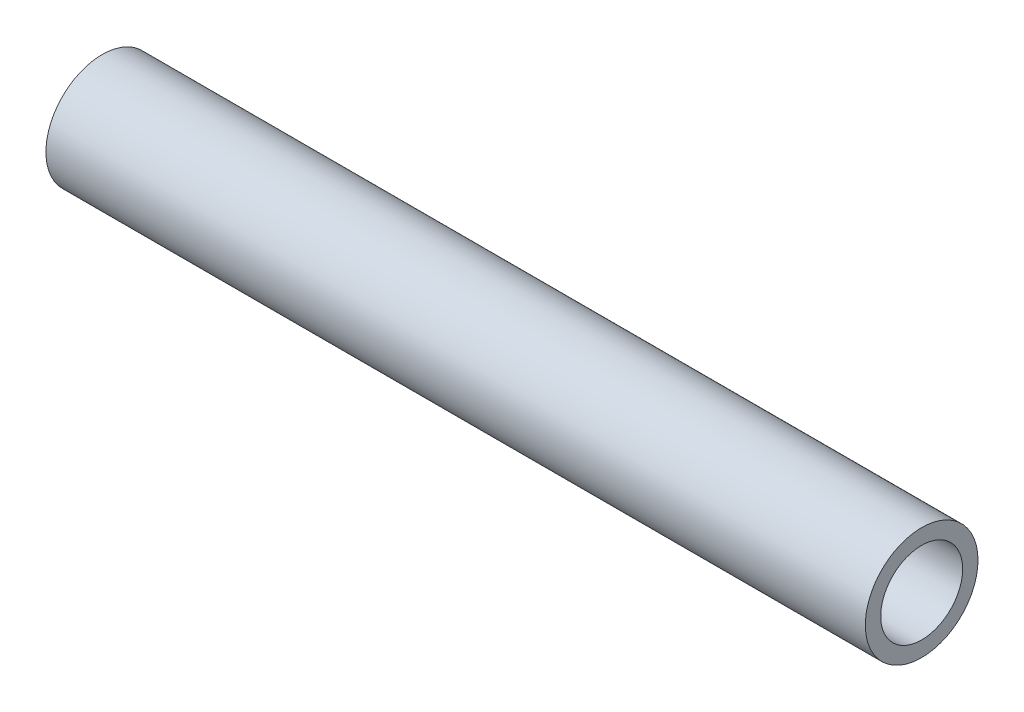
ISO-10303-21;
HEADER;
FILE_DESCRIPTION(('STEP AP214'),'2;1');
FILE_NAME('part.step','',(''),(''),'','','');
FILE_SCHEMA(('AUTOMOTIVE_DESIGN { 1 0 10303 214 1 1 1 1 }'));
ENDSEC;
DATA;
#1=APPLICATION_CONTEXT('core data for automotive mechanical design processes');
#2=APPLICATION_PROTOCOL_DEFINITION('international standard','automotive_design',2000,#1);
#3=PRODUCT_CONTEXT('',#1,'mechanical');
#4=PRODUCT('Part','Part','',(#3));
#5=PRODUCT_RELATED_PRODUCT_CATEGORY('part','',(#4));
#6=PRODUCT_DEFINITION_FORMATION('','',#4);
#7=PRODUCT_DEFINITION_CONTEXT('part definition',#1,'design');
#8=PRODUCT_DEFINITION('design','',#6,#7);
#9=PRODUCT_DEFINITION_SHAPE('','',#8);
#10=(LENGTH_UNIT() NAMED_UNIT(*) SI_UNIT(.MILLI.,.METRE.));
#11=(NAMED_UNIT(*) PLANE_ANGLE_UNIT() SI_UNIT($,.RADIAN.));
#12=(NAMED_UNIT(*) SI_UNIT($,.STERADIAN.) SOLID_ANGLE_UNIT());
#13=UNCERTAINTY_MEASURE_WITH_UNIT(LENGTH_MEASURE(1.E-05),#10,'distance_accuracy_value','');
#14=(GEOMETRIC_REPRESENTATION_CONTEXT(3) GLOBAL_UNCERTAINTY_ASSIGNED_CONTEXT((#13)) GLOBAL_UNIT_ASSIGNED_CONTEXT((#10,
#11,#12)) REPRESENTATION_CONTEXT('',''));
#15=CARTESIAN_POINT('',(0.,0.,0.));
#16=DIRECTION('',(0.,0.,1.));
#17=DIRECTION('',(1.,0.,0.));
#18=AXIS2_PLACEMENT_3D('',#15,#16,#17);
#19=CARTESIAN_POINT('',(160.,0.,0.));
#20=DIRECTION('',(1.,0.,0.));
#21=DIRECTION('',(0.,0.,-1.));
#22=AXIS2_PLACEMENT_3D('',#19,#20,#21);
#23=PLANE('',#22);
#24=CARTESIAN_POINT('',(160.,0.,0.));
#25=DIRECTION('',(1.,0.,0.));
#26=DIRECTION('',(0.,0.,-1.));
#27=AXIS2_PLACEMENT_3D('',#24,#25,#26);
#28=CIRCLE('',#27,11.);
#29=CARTESIAN_POINT('',(160.,0.,-11.));
#30=VERTEX_POINT('',#29);
#31=EDGE_CURVE('E10',#30,#30,#28,.T.);
#32=ORIENTED_EDGE('',*,*,#31,.T.);
#33=EDGE_LOOP('',(#32));
#34=FACE_BOUND('',#33,.T.);
#35=CARTESIAN_POINT('',(160.,0.,0.));
#36=DIRECTION('',(1.,0.,0.));
#37=DIRECTION('',(0.,0.,-1.));
#38=AXIS2_PLACEMENT_3D('',#35,#36,#37);
#39=CIRCLE('',#38,8.);
#40=CARTESIAN_POINT('',(160.,0.,-8.));
#41=VERTEX_POINT('',#40);
#42=EDGE_CURVE('E42',#41,#41,#39,.T.);
#43=ORIENTED_EDGE('',*,*,#42,.F.);
#44=EDGE_LOOP('',(#43));
#45=FACE_BOUND('',#44,.T.);
#46=ADVANCED_FACE('F31',(#34,#45),#23,.T.);
#47=CARTESIAN_POINT('',(0.,0.,0.));
#48=DIRECTION('',(1.,0.,0.));
#49=DIRECTION('',(0.,0.,-1.));
#50=AXIS2_PLACEMENT_3D('',#47,#48,#49);
#51=PLANE('',#50);
#52=CARTESIAN_POINT('',(0.,0.,0.));
#53=DIRECTION('',(1.,0.,0.));
#54=DIRECTION('',(0.,0.,-1.));
#55=AXIS2_PLACEMENT_3D('',#52,#53,#54);
#56=CIRCLE('',#55,11.);
#57=CARTESIAN_POINT('',(0.,0.,-11.));
#58=VERTEX_POINT('',#57);
#59=EDGE_CURVE('E35',#58,#58,#56,.T.);
#60=ORIENTED_EDGE('',*,*,#59,.F.);
#61=EDGE_LOOP('',(#60));
#62=FACE_BOUND('',#61,.T.);
#63=CARTESIAN_POINT('',(0.,0.,0.));
#64=DIRECTION('',(1.,0.,0.));
#65=DIRECTION('',(0.,0.,-1.));
#66=AXIS2_PLACEMENT_3D('',#63,#64,#65);
#67=CIRCLE('',#66,8.);
#68=CARTESIAN_POINT('',(0.,0.,-8.));
#69=VERTEX_POINT('',#68);
#70=EDGE_CURVE('E44',#69,#69,#67,.T.);
#71=ORIENTED_EDGE('',*,*,#70,.T.);
#72=EDGE_LOOP('',(#71));
#73=FACE_BOUND('',#72,.T.);
#74=ADVANCED_FACE('F54',(#62,#73),#51,.F.);
#75=CARTESIAN_POINT('',(160.,0.,0.));
#76=DIRECTION('',(-1.,0.,0.));
#77=DIRECTION('',(0.,0.,1.));
#78=AXIS2_PLACEMENT_3D('',#75,#76,#77);
#79=CYLINDRICAL_SURFACE('',#78,11.);
#80=ORIENTED_EDGE('',*,*,#31,.F.);
#81=EDGE_LOOP('',(#80));
#82=FACE_BOUND('',#81,.T.);
#83=ORIENTED_EDGE('',*,*,#59,.T.);
#84=EDGE_LOOP('',(#83));
#85=FACE_BOUND('',#84,.T.);
#86=ADVANCED_FACE('F33',(#82,#85),#79,.T.);
#87=CARTESIAN_POINT('',(160.,0.,0.));
#88=DIRECTION('',(-1.,0.,0.));
#89=DIRECTION('',(0.,0.,1.));
#90=AXIS2_PLACEMENT_3D('',#87,#88,#89);
#91=CYLINDRICAL_SURFACE('',#90,8.);
#92=ORIENTED_EDGE('',*,*,#42,.T.);
#93=EDGE_LOOP('',(#92));
#94=FACE_BOUND('',#93,.T.);
#95=ORIENTED_EDGE('',*,*,#70,.F.);
#96=EDGE_LOOP('',(#95));
#97=FACE_BOUND('',#96,.T.);
#98=ADVANCED_FACE('F50',(#94,#97),#91,.F.);
#99=CLOSED_SHELL('',(#46,#74,#86,#98));
#100=MANIFOLD_SOLID_BREP('B2',#99);
#101=ADVANCED_BREP_SHAPE_REPRESENTATION('',(#18,#100),#14);
#102=SHAPE_DEFINITION_REPRESENTATION(#9,#101);
ENDSEC;
END-ISO-10303-21;
